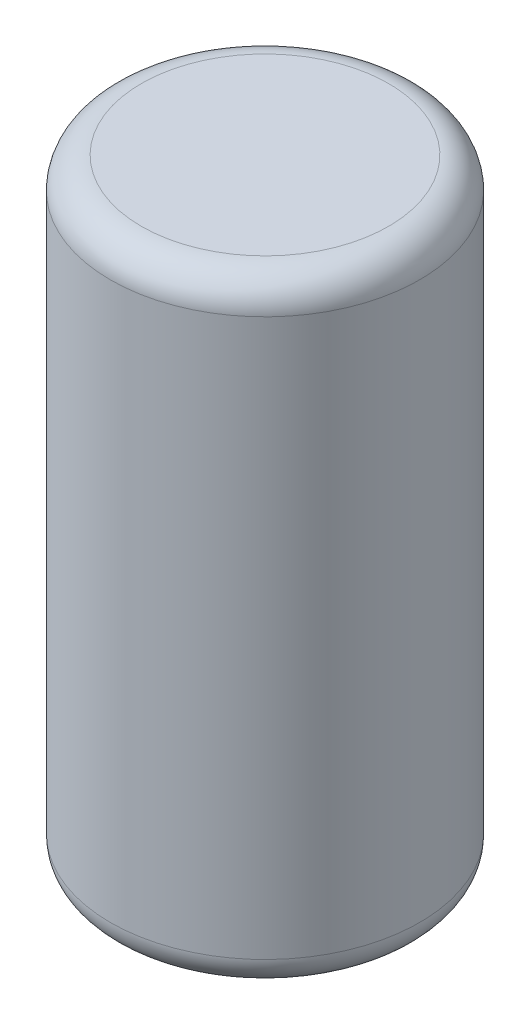
ISO-10303-21;
HEADER;
FILE_DESCRIPTION(('STEP AP214'),'2;1');
FILE_NAME('part.step','',(''),(''),'','','');
FILE_SCHEMA(('AUTOMOTIVE_DESIGN { 1 0 10303 214 1 1 1 1 }'));
ENDSEC;
DATA;
#1=APPLICATION_CONTEXT('core data for automotive mechanical design processes');
#2=APPLICATION_PROTOCOL_DEFINITION('international standard','automotive_design',2000,#1);
#3=PRODUCT_CONTEXT('',#1,'mechanical');
#4=PRODUCT('Part','Part','',(#3));
#5=PRODUCT_RELATED_PRODUCT_CATEGORY('part','',(#4));
#6=PRODUCT_DEFINITION_FORMATION('','',#4);
#7=PRODUCT_DEFINITION_CONTEXT('part definition',#1,'design');
#8=PRODUCT_DEFINITION('design','',#6,#7);
#9=PRODUCT_DEFINITION_SHAPE('','',#8);
#10=(LENGTH_UNIT() NAMED_UNIT(*) SI_UNIT(.MILLI.,.METRE.));
#11=(NAMED_UNIT(*) PLANE_ANGLE_UNIT() SI_UNIT($,.RADIAN.));
#12=(NAMED_UNIT(*) SI_UNIT($,.STERADIAN.) SOLID_ANGLE_UNIT());
#13=UNCERTAINTY_MEASURE_WITH_UNIT(LENGTH_MEASURE(1.E-05),#10,'distance_accuracy_value','');
#14=(GEOMETRIC_REPRESENTATION_CONTEXT(3) GLOBAL_UNCERTAINTY_ASSIGNED_CONTEXT((#13)) GLOBAL_UNIT_ASSIGNED_CONTEXT((#10,
#11,#12)) REPRESENTATION_CONTEXT('',''));
#15=CARTESIAN_POINT('',(0.,0.,0.));
#16=DIRECTION('',(0.,0.,1.));
#17=DIRECTION('',(1.,0.,0.));
#18=AXIS2_PLACEMENT_3D('',#15,#16,#17);
#19=CARTESIAN_POINT('',(0.,0.,0.));
#20=DIRECTION('',(0.,1.,0.));
#21=DIRECTION('',(1.,0.,0.));
#22=AXIS2_PLACEMENT_3D('',#19,#20,#21);
#23=PLANE('',#22);
#24=CARTESIAN_POINT('',(0.,0.,0.));
#25=DIRECTION('',(0.,-1.,0.));
#26=DIRECTION('',(0.,0.,1.));
#27=AXIS2_PLACEMENT_3D('',#24,#25,#26);
#28=CIRCLE('',#27,2.54);
#29=CARTESIAN_POINT('',(0.,0.,2.54));
#30=VERTEX_POINT('',#29);
#31=EDGE_CURVE('E21',#30,#30,#28,.T.);
#32=ORIENTED_EDGE('',*,*,#31,.T.);
#33=EDGE_LOOP('',(#32));
#34=FACE_BOUND('',#33,.T.);
#35=ADVANCED_FACE('F14',(#34),#23,.F.);
#36=CARTESIAN_POINT('',(0.,12.7,0.));
#37=DIRECTION('',(0.,1.,0.));
#38=DIRECTION('',(1.,0.,0.));
#39=AXIS2_PLACEMENT_3D('',#36,#37,#38);
#40=PLANE('',#39);
#41=CARTESIAN_POINT('',(0.,12.7,0.));
#42=DIRECTION('',(0.,1.,0.));
#43=DIRECTION('',(0.,0.,1.));
#44=AXIS2_PLACEMENT_3D('',#41,#42,#43);
#45=CIRCLE('',#44,2.54);
#46=CARTESIAN_POINT('',(0.,12.7,2.54));
#47=VERTEX_POINT('',#46);
#48=EDGE_CURVE('E28',#47,#47,#45,.T.);
#49=ORIENTED_EDGE('',*,*,#48,.T.);
#50=EDGE_LOOP('',(#49));
#51=FACE_BOUND('',#50,.T.);
#52=ADVANCED_FACE('F62',(#51),#40,.T.);
#53=CARTESIAN_POINT('',(0.,12.7,0.));
#54=DIRECTION('',(0.,-1.,0.));
#55=DIRECTION('',(0.,0.,-1.));
#56=AXIS2_PLACEMENT_3D('',#53,#54,#55);
#57=CYLINDRICAL_SURFACE('',#56,3.175);
#58=CARTESIAN_POINT('',(0.,0.635,0.));
#59=DIRECTION('',(0.,1.,0.));
#60=DIRECTION('',(0.,0.,1.));
#61=AXIS2_PLACEMENT_3D('',#58,#59,#60);
#62=CIRCLE('',#61,3.175);
#63=CARTESIAN_POINT('',(0.,0.635,3.175));
#64=VERTEX_POINT('',#63);
#65=EDGE_CURVE('E10',#64,#64,#62,.T.);
#66=ORIENTED_EDGE('',*,*,#65,.T.);
#67=EDGE_LOOP('',(#66));
#68=FACE_BOUND('',#67,.T.);
#69=CARTESIAN_POINT('',(0.,12.065,0.));
#70=DIRECTION('',(0.,-1.,0.));
#71=DIRECTION('',(0.,0.,1.));
#72=AXIS2_PLACEMENT_3D('',#69,#70,#71);
#73=CIRCLE('',#72,3.175);
#74=CARTESIAN_POINT('',(0.,12.065,3.175));
#75=VERTEX_POINT('',#74);
#76=EDGE_CURVE('E36',#75,#75,#73,.T.);
#77=ORIENTED_EDGE('',*,*,#76,.T.);
#78=EDGE_LOOP('',(#77));
#79=FACE_BOUND('',#78,.T.);
#80=ADVANCED_FACE('F46',(#68,#79),#57,.T.);
#81=CARTESIAN_POINT('',(0.,0.635,0.));
#82=DIRECTION('',(0.,1.,0.));
#83=DIRECTION('',(0.,0.,1.));
#84=AXIS2_PLACEMENT_3D('',#81,#82,#83);
#85=TOROIDAL_SURFACE('',#84,2.54,0.635);
#86=ORIENTED_EDGE('',*,*,#65,.F.);
#87=EDGE_LOOP('',(#86));
#88=FACE_BOUND('',#87,.T.);
#89=ORIENTED_EDGE('',*,*,#31,.F.);
#90=EDGE_LOOP('',(#89));
#91=FACE_BOUND('',#90,.T.);
#92=ADVANCED_FACE('F49',(#88,#91),#85,.T.);
#93=CARTESIAN_POINT('',(0.,12.065,0.));
#94=DIRECTION('',(0.,1.,0.));
#95=DIRECTION('',(0.,0.,1.));
#96=AXIS2_PLACEMENT_3D('',#93,#94,#95);
#97=TOROIDAL_SURFACE('',#96,2.54,0.635);
#98=ORIENTED_EDGE('',*,*,#48,.F.);
#99=EDGE_LOOP('',(#98));
#100=FACE_BOUND('',#99,.T.);
#101=ORIENTED_EDGE('',*,*,#76,.F.);
#102=EDGE_LOOP('',(#101));
#103=FACE_BOUND('',#102,.T.);
#104=ADVANCED_FACE('F48',(#100,#103),#97,.T.);
#105=CLOSED_SHELL('',(#35,#52,#80,#92,#104));
#106=MANIFOLD_SOLID_BREP('B1',#105);
#107=ADVANCED_BREP_SHAPE_REPRESENTATION('',(#18,#106),#14);
#108=SHAPE_DEFINITION_REPRESENTATION(#9,#107);
ENDSEC;
END-ISO-10303-21;
